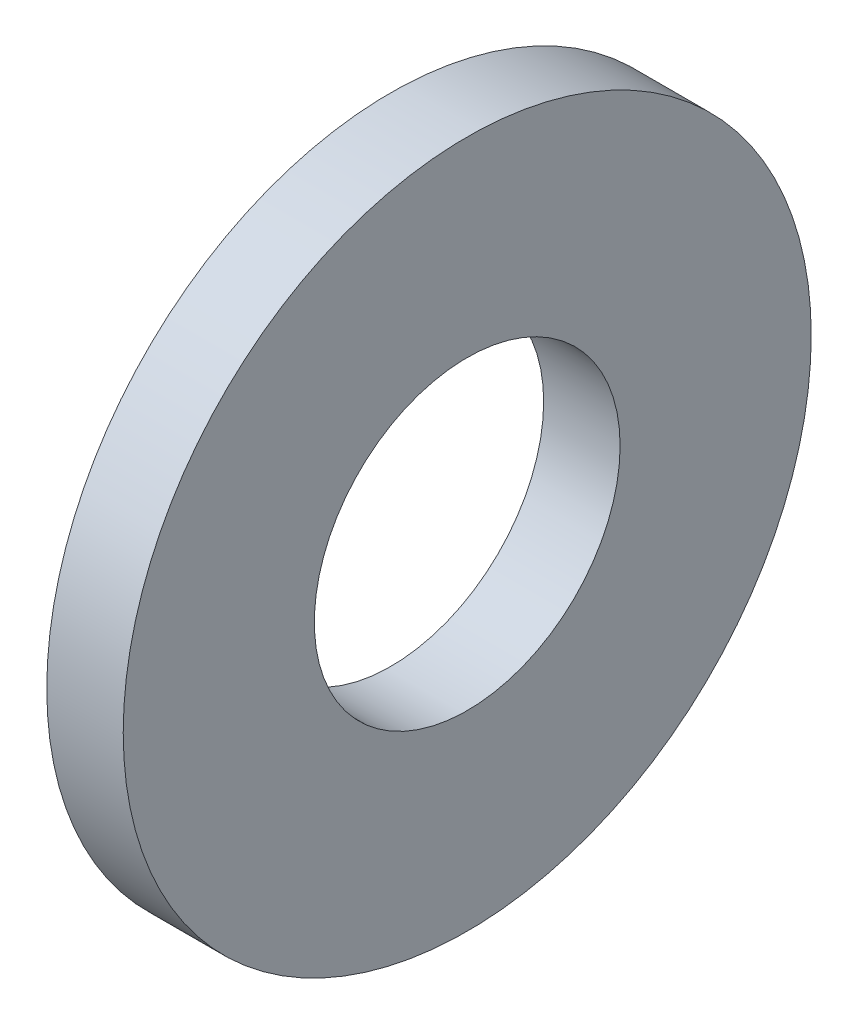
ISO-10303-21;
HEADER;
FILE_DESCRIPTION(('STEP AP214'),'2;1');
FILE_NAME('part.step','',(''),(''),'','','');
FILE_SCHEMA(('AUTOMOTIVE_DESIGN { 1 0 10303 214 1 1 1 1 }'));
ENDSEC;
DATA;
#1=APPLICATION_CONTEXT('core data for automotive mechanical design processes');
#2=APPLICATION_PROTOCOL_DEFINITION('international standard','automotive_design',2000,#1);
#3=PRODUCT_CONTEXT('',#1,'mechanical');
#4=PRODUCT('Part','Part','',(#3));
#5=PRODUCT_RELATED_PRODUCT_CATEGORY('part','',(#4));
#6=PRODUCT_DEFINITION_FORMATION('','',#4);
#7=PRODUCT_DEFINITION_CONTEXT('part definition',#1,'design');
#8=PRODUCT_DEFINITION('design','',#6,#7);
#9=PRODUCT_DEFINITION_SHAPE('','',#8);
#10=(LENGTH_UNIT() NAMED_UNIT(*) SI_UNIT(.MILLI.,.METRE.));
#11=(NAMED_UNIT(*) PLANE_ANGLE_UNIT() SI_UNIT($,.RADIAN.));
#12=(NAMED_UNIT(*) SI_UNIT($,.STERADIAN.) SOLID_ANGLE_UNIT());
#13=UNCERTAINTY_MEASURE_WITH_UNIT(LENGTH_MEASURE(1.E-05),#10,'distance_accuracy_value','');
#14=(GEOMETRIC_REPRESENTATION_CONTEXT(3) GLOBAL_UNCERTAINTY_ASSIGNED_CONTEXT((#13)) GLOBAL_UNIT_ASSIGNED_CONTEXT((#10,
#11,#12)) REPRESENTATION_CONTEXT('',''));
#15=CARTESIAN_POINT('',(0.,0.,0.));
#16=DIRECTION('',(0.,0.,1.));
#17=DIRECTION('',(1.,0.,0.));
#18=AXIS2_PLACEMENT_3D('',#15,#16,#17);
#19=CARTESIAN_POINT('',(2.,0.,0.));
#20=DIRECTION('',(-1.,0.,0.));
#21=DIRECTION('',(0.,0.,1.));
#22=AXIS2_PLACEMENT_3D('',#19,#20,#21);
#23=CYLINDRICAL_SURFACE('',#22,9.);
#24=CARTESIAN_POINT('',(2.,0.,0.));
#25=DIRECTION('',(1.,0.,0.));
#26=DIRECTION('',(0.,0.,-1.));
#27=AXIS2_PLACEMENT_3D('',#24,#25,#26);
#28=CIRCLE('',#27,9.);
#29=CARTESIAN_POINT('',(2.,0.,-9.));
#30=VERTEX_POINT('',#29);
#31=EDGE_CURVE('E10',#30,#30,#28,.T.);
#32=ORIENTED_EDGE('',*,*,#31,.F.);
#33=EDGE_LOOP('',(#32));
#34=FACE_BOUND('',#33,.T.);
#35=CARTESIAN_POINT('',(0.,0.,0.));
#36=DIRECTION('',(1.,0.,0.));
#37=DIRECTION('',(0.,0.,-1.));
#38=AXIS2_PLACEMENT_3D('',#35,#36,#37);
#39=CIRCLE('',#38,9.);
#40=CARTESIAN_POINT('',(0.,0.,-9.));
#41=VERTEX_POINT('',#40);
#42=EDGE_CURVE('E33',#41,#41,#39,.T.);
#43=ORIENTED_EDGE('',*,*,#42,.T.);
#44=EDGE_LOOP('',(#43));
#45=FACE_BOUND('',#44,.T.);
#46=ADVANCED_FACE('F30',(#34,#45),#23,.T.);
#47=CARTESIAN_POINT('',(2.,0.,0.));
#48=DIRECTION('',(1.,0.,0.));
#49=DIRECTION('',(0.,0.,-1.));
#50=AXIS2_PLACEMENT_3D('',#47,#48,#49);
#51=PLANE('',#50);
#52=CARTESIAN_POINT('',(2.,0.,0.));
#53=DIRECTION('',(1.,0.,0.));
#54=DIRECTION('',(0.,0.,-1.));
#55=AXIS2_PLACEMENT_3D('',#52,#53,#54);
#56=CIRCLE('',#55,4.);
#57=CARTESIAN_POINT('',(2.,0.,-4.));
#58=VERTEX_POINT('',#57);
#59=EDGE_CURVE('E42',#58,#58,#56,.T.);
#60=ORIENTED_EDGE('',*,*,#59,.F.);
#61=EDGE_LOOP('',(#60));
#62=FACE_BOUND('',#61,.T.);
#63=ORIENTED_EDGE('',*,*,#31,.T.);
#64=EDGE_LOOP('',(#63));
#65=FACE_BOUND('',#64,.T.);
#66=ADVANCED_FACE('F57',(#62,#65),#51,.T.);
#67=CARTESIAN_POINT('',(0.,0.,0.));
#68=DIRECTION('',(1.,0.,0.));
#69=DIRECTION('',(0.,0.,-1.));
#70=AXIS2_PLACEMENT_3D('',#67,#68,#69);
#71=PLANE('',#70);
#72=CARTESIAN_POINT('',(0.,0.,0.));
#73=DIRECTION('',(1.,0.,0.));
#74=DIRECTION('',(0.,0.,-1.));
#75=AXIS2_PLACEMENT_3D('',#72,#73,#74);
#76=CIRCLE('',#75,4.);
#77=CARTESIAN_POINT('',(0.,0.,-4.));
#78=VERTEX_POINT('',#77);
#79=EDGE_CURVE('E40',#78,#78,#76,.T.);
#80=ORIENTED_EDGE('',*,*,#79,.T.);
#81=EDGE_LOOP('',(#80));
#82=FACE_BOUND('',#81,.T.);
#83=ORIENTED_EDGE('',*,*,#42,.F.);
#84=EDGE_LOOP('',(#83));
#85=FACE_BOUND('',#84,.T.);
#86=ADVANCED_FACE('F48',(#82,#85),#71,.F.);
#87=CARTESIAN_POINT('',(0.,0.,0.));
#88=DIRECTION('',(1.,0.,0.));
#89=DIRECTION('',(0.,0.,-1.));
#90=AXIS2_PLACEMENT_3D('',#87,#88,#89);
#91=CYLINDRICAL_SURFACE('',#90,4.);
#92=ORIENTED_EDGE('',*,*,#79,.F.);
#93=EDGE_LOOP('',(#92));
#94=FACE_BOUND('',#93,.T.);
#95=ORIENTED_EDGE('',*,*,#59,.T.);
#96=EDGE_LOOP('',(#95));
#97=FACE_BOUND('',#96,.T.);
#98=ADVANCED_FACE('F51',(#94,#97),#91,.F.);
#99=CLOSED_SHELL('',(#46,#66,#86,#98));
#100=MANIFOLD_SOLID_BREP('B2',#99);
#101=ADVANCED_BREP_SHAPE_REPRESENTATION('',(#18,#100),#14);
#102=SHAPE_DEFINITION_REPRESENTATION(#9,#101);
ENDSEC;
END-ISO-10303-21;
